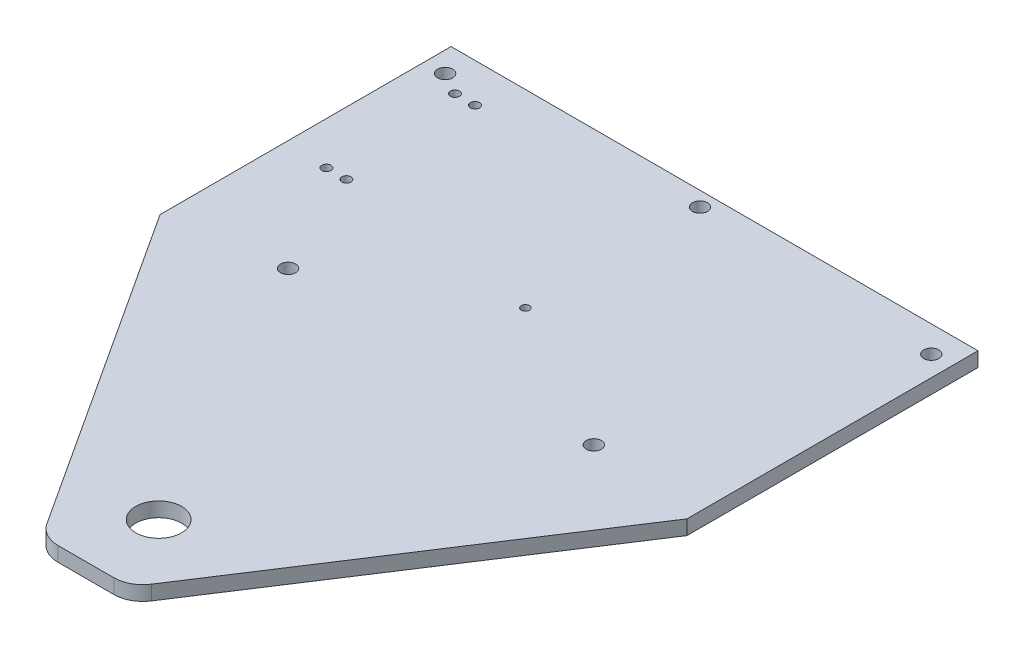
ISO-10303-21;
HEADER;
FILE_DESCRIPTION(('STEP AP214'),'2;1');
FILE_NAME('part.step','',(''),(''),'','','');
FILE_SCHEMA(('AUTOMOTIVE_DESIGN { 1 0 10303 214 1 1 1 1 }'));
ENDSEC;
DATA;
#1=APPLICATION_CONTEXT('core data for automotive mechanical design processes');
#2=APPLICATION_PROTOCOL_DEFINITION('international standard','automotive_design',2000,#1);
#3=PRODUCT_CONTEXT('',#1,'mechanical');
#4=PRODUCT('Part','Part','',(#3));
#5=PRODUCT_RELATED_PRODUCT_CATEGORY('part','',(#4));
#6=PRODUCT_DEFINITION_FORMATION('','',#4);
#7=PRODUCT_DEFINITION_CONTEXT('part definition',#1,'design');
#8=PRODUCT_DEFINITION('design','',#6,#7);
#9=PRODUCT_DEFINITION_SHAPE('','',#8);
#10=(LENGTH_UNIT() NAMED_UNIT(*) SI_UNIT(.MILLI.,.METRE.));
#11=(NAMED_UNIT(*) PLANE_ANGLE_UNIT() SI_UNIT($,.RADIAN.));
#12=(NAMED_UNIT(*) SI_UNIT($,.STERADIAN.) SOLID_ANGLE_UNIT());
#13=UNCERTAINTY_MEASURE_WITH_UNIT(LENGTH_MEASURE(1.E-05),#10,'distance_accuracy_value','');
#14=(GEOMETRIC_REPRESENTATION_CONTEXT(3) GLOBAL_UNCERTAINTY_ASSIGNED_CONTEXT((#13)) GLOBAL_UNIT_ASSIGNED_CONTEXT((#10,
#11,#12)) REPRESENTATION_CONTEXT('',''));
#15=CARTESIAN_POINT('',(0.,0.,0.));
#16=DIRECTION('',(0.,0.,1.));
#17=DIRECTION('',(1.,0.,0.));
#18=AXIS2_PLACEMENT_3D('',#15,#16,#17);
#19=CARTESIAN_POINT('',(-68.3666105948794,19.49,44.5148786296983));
#20=DIRECTION('',(-0.83801441935241,0.,0.545648085268742));
#21=DIRECTION('',(0.545648085268742,0.,0.83801441935241));
#22=AXIS2_PLACEMENT_3D('',#19,#20,#21);
#23=PLANE('',#22);
#24=DIRECTION('',(-0.545648085268742,0.,-0.83801441935241));
#25=VECTOR('',#24,1.);
#26=CARTESIAN_POINT('',(-68.3666105948794,16.315,44.5148786296983));
#27=LINE('',#26,#25);
#28=CARTESIAN_POINT('',(-36.8035693489561,16.315,92.9898653414566));
#29=VERTEX_POINT('',#28);
#30=CARTESIAN_POINT('',(-82.88,16.315,22.225));
#31=VERTEX_POINT('',#30);
#32=EDGE_CURVE('E158',#29,#31,#27,.T.);
#33=ORIENTED_EDGE('',*,*,#32,.F.);
#34=DIRECTION('',(0.,-1.,0.));
#35=VECTOR('',#34,1.);
#36=CARTESIAN_POINT('',(-36.8035693489561,19.49,92.9898653414565));
#37=LINE('',#36,#35);
#38=CARTESIAN_POINT('',(-36.8035693489561,19.49,92.9898653414566));
#39=VERTEX_POINT('',#38);
#40=EDGE_CURVE('E66',#29,#39,#37,.F.);
#41=ORIENTED_EDGE('',*,*,#40,.T.);
#42=DIRECTION('',(-0.545648085268742,0.,-0.83801441935241));
#43=VECTOR('',#42,1.);
#44=CARTESIAN_POINT('',(-68.3666105948794,19.49,44.5148786296983));
#45=LINE('',#44,#43);
#46=CARTESIAN_POINT('',(-82.88,19.49,22.225));
#47=VERTEX_POINT('',#46);
#48=EDGE_CURVE('E134',#39,#47,#45,.T.);
#49=ORIENTED_EDGE('',*,*,#48,.T.);
#50=DIRECTION('',(0.,-1.,0.));
#51=VECTOR('',#50,1.);
#52=CARTESIAN_POINT('',(-82.88,19.49,22.225));
#53=LINE('',#52,#51);
#54=EDGE_CURVE('E157',#47,#31,#53,.T.);
#55=ORIENTED_EDGE('',*,*,#54,.T.);
#56=EDGE_LOOP('',(#33,#41,#49,#55));
#57=FACE_BOUND('',#56,.T.);
#58=ADVANCED_FACE('F43',(#57),#23,.T.);
#59=CARTESIAN_POINT('',(0.,19.49,95.875));
#60=DIRECTION('',(0.,0.,1.));
#61=DIRECTION('',(1.,0.,0.));
#62=AXIS2_PLACEMENT_3D('',#59,#60,#61);
#63=PLANE('',#62);
#64=DIRECTION('',(-1.,0.,0.));
#65=VECTOR('',#64,1.);
#66=CARTESIAN_POINT('',(0.,19.49,95.875));
#67=LINE('',#66,#65);
#68=CARTESIAN_POINT('',(-19.3178222139362,19.49,95.875));
#69=VERTEX_POINT('',#68);
#70=CARTESIAN_POINT('',(-31.4821777860683,19.49,95.875));
#71=VERTEX_POINT('',#70);
#72=EDGE_CURVE('E131',#69,#71,#67,.T.);
#73=ORIENTED_EDGE('',*,*,#72,.T.);
#74=DIRECTION('',(0.,-1.,0.));
#75=VECTOR('',#74,1.);
#76=CARTESIAN_POINT('',(-31.4821777860683,19.49,95.875));
#77=LINE('',#76,#75);
#78=CARTESIAN_POINT('',(-31.4821777860683,16.315,95.875));
#79=VERTEX_POINT('',#78);
#80=EDGE_CURVE('E194',#71,#79,#77,.T.);
#81=ORIENTED_EDGE('',*,*,#80,.T.);
#82=DIRECTION('',(-1.,0.,0.));
#83=VECTOR('',#82,1.);
#84=CARTESIAN_POINT('',(0.,16.315,95.875));
#85=LINE('',#84,#83);
#86=CARTESIAN_POINT('',(-19.3178222139362,16.315,95.875));
#87=VERTEX_POINT('',#86);
#88=EDGE_CURVE('E160',#87,#79,#85,.T.);
#89=ORIENTED_EDGE('',*,*,#88,.F.);
#90=DIRECTION('',(0.,-1.,0.));
#91=VECTOR('',#90,1.);
#92=CARTESIAN_POINT('',(-19.3178222139362,19.49,95.875));
#93=LINE('',#92,#91);
#94=EDGE_CURVE('E119',#87,#69,#93,.F.);
#95=ORIENTED_EDGE('',*,*,#94,.T.);
#96=EDGE_LOOP('',(#73,#81,#89,#95));
#97=FACE_BOUND('',#96,.T.);
#98=ADVANCED_FACE('F206',(#97),#63,.T.);
#99=CARTESIAN_POINT('',(32.6913877091167,19.49,21.2860216916601));
#100=DIRECTION('',(0.838014419352385,0.,0.545648085268779));
#101=DIRECTION('',(0.545648085268779,0.,-0.838014419352385));
#102=AXIS2_PLACEMENT_3D('',#99,#100,#101);
#103=PLANE('',#102);
#104=DIRECTION('',(-0.545648085268779,0.,0.838014419352385));
#105=VECTOR('',#104,1.);
#106=CARTESIAN_POINT('',(32.6913877091167,19.49,21.2860216916601));
#107=LINE('',#106,#105);
#108=CARTESIAN_POINT('',(32.08,19.49,22.225));
#109=VERTEX_POINT('',#108);
#110=CARTESIAN_POINT('',(-13.9964306510485,19.49,92.9898653414568));
#111=VERTEX_POINT('',#110);
#112=EDGE_CURVE('E113',#109,#111,#107,.T.);
#113=ORIENTED_EDGE('',*,*,#112,.T.);
#114=DIRECTION('',(0.,-1.,0.));
#115=VECTOR('',#114,1.);
#116=CARTESIAN_POINT('',(-13.9964306510485,19.49,92.9898653414568));
#117=LINE('',#116,#115);
#118=CARTESIAN_POINT('',(-13.9964306510485,16.315,92.9898653414568));
#119=VERTEX_POINT('',#118);
#120=EDGE_CURVE('E11',#111,#119,#117,.T.);
#121=ORIENTED_EDGE('',*,*,#120,.T.);
#122=DIRECTION('',(-0.545648085268779,0.,0.838014419352385));
#123=VECTOR('',#122,1.);
#124=CARTESIAN_POINT('',(32.6913877091167,16.315,21.2860216916601));
#125=LINE('',#124,#123);
#126=CARTESIAN_POINT('',(32.08,16.315,22.225));
#127=VERTEX_POINT('',#126);
#128=EDGE_CURVE('E116',#127,#119,#125,.T.);
#129=ORIENTED_EDGE('',*,*,#128,.F.);
#130=DIRECTION('',(0.,-1.,0.));
#131=VECTOR('',#130,1.);
#132=CARTESIAN_POINT('',(32.08,19.49,22.225));
#133=LINE('',#132,#131);
#134=EDGE_CURVE('E110',#109,#127,#133,.T.);
#135=ORIENTED_EDGE('',*,*,#134,.F.);
#136=EDGE_LOOP('',(#113,#121,#129,#135));
#137=FACE_BOUND('',#136,.T.);
#138=ADVANCED_FACE('F112',(#137),#103,.T.);
#139=CARTESIAN_POINT('',(32.08,19.49,0.));
#140=DIRECTION('',(-1.,0.,0.));
#141=DIRECTION('',(0.,0.,1.));
#142=AXIS2_PLACEMENT_3D('',#139,#140,#141);
#143=PLANE('',#142);
#144=DIRECTION('',(0.,0.,-1.));
#145=VECTOR('',#144,1.);
#146=CARTESIAN_POINT('',(32.08,16.315,0.));
#147=LINE('',#146,#145);
#148=CARTESIAN_POINT('',(32.08,16.315,-41.275));
#149=VERTEX_POINT('',#148);
#150=EDGE_CURVE('E165',#127,#149,#147,.T.);
#151=ORIENTED_EDGE('',*,*,#150,.T.);
#152=DIRECTION('',(0.,-1.,0.));
#153=VECTOR('',#152,1.);
#154=CARTESIAN_POINT('',(32.08,19.49,-41.275));
#155=LINE('',#154,#153);
#156=CARTESIAN_POINT('',(32.08,19.49,-41.275));
#157=VERTEX_POINT('',#156);
#158=EDGE_CURVE('E120',#157,#149,#155,.T.);
#159=ORIENTED_EDGE('',*,*,#158,.F.);
#160=DIRECTION('',(0.,0.,-1.));
#161=VECTOR('',#160,1.);
#162=CARTESIAN_POINT('',(32.08,19.49,0.));
#163=LINE('',#162,#161);
#164=EDGE_CURVE('E123',#109,#157,#163,.T.);
#165=ORIENTED_EDGE('',*,*,#164,.F.);
#166=ORIENTED_EDGE('',*,*,#134,.T.);
#167=EDGE_LOOP('',(#151,#159,#165,#166));
#168=FACE_BOUND('',#167,.T.);
#169=ADVANCED_FACE('F124',(#168),#143,.F.);
#170=CARTESIAN_POINT('',(0.,19.49,-41.275));
#171=DIRECTION('',(0.,0.,1.));
#172=DIRECTION('',(1.,0.,0.));
#173=AXIS2_PLACEMENT_3D('',#170,#171,#172);
#174=PLANE('',#173);
#175=DIRECTION('',(-1.,0.,0.));
#176=VECTOR('',#175,1.);
#177=CARTESIAN_POINT('',(0.,16.315,-41.275));
#178=LINE('',#177,#176);
#179=CARTESIAN_POINT('',(-82.88,16.315,-41.275));
#180=VERTEX_POINT('',#179);
#181=EDGE_CURVE('E167',#149,#180,#178,.T.);
#182=ORIENTED_EDGE('',*,*,#181,.T.);
#183=DIRECTION('',(0.,-1.,0.));
#184=VECTOR('',#183,1.);
#185=CARTESIAN_POINT('',(-82.88,19.49,-41.275));
#186=LINE('',#185,#184);
#187=CARTESIAN_POINT('',(-82.88,19.49,-41.275));
#188=VERTEX_POINT('',#187);
#189=EDGE_CURVE('E189',#188,#180,#186,.T.);
#190=ORIENTED_EDGE('',*,*,#189,.F.);
#191=DIRECTION('',(-1.,0.,0.));
#192=VECTOR('',#191,1.);
#193=CARTESIAN_POINT('',(0.,19.49,-41.275));
#194=LINE('',#193,#192);
#195=EDGE_CURVE('E127',#157,#188,#194,.T.);
#196=ORIENTED_EDGE('',*,*,#195,.F.);
#197=ORIENTED_EDGE('',*,*,#158,.T.);
#198=EDGE_LOOP('',(#182,#190,#196,#197));
#199=FACE_BOUND('',#198,.T.);
#200=ADVANCED_FACE('F221',(#199),#174,.F.);
#201=CARTESIAN_POINT('',(7.95000000000004,19.49,18.415));
#202=DIRECTION('',(0.,-1.,0.));
#203=DIRECTION('',(0.,0.,-1.));
#204=AXIS2_PLACEMENT_3D('',#201,#202,#203);
#205=CYLINDRICAL_SURFACE('',#204,1.64999999999999);
#206=CARTESIAN_POINT('',(7.95000000000004,19.49,18.415));
#207=DIRECTION('',(0.,1.,0.));
#208=DIRECTION('',(0.,0.,1.));
#209=AXIS2_PLACEMENT_3D('',#206,#207,#208);
#210=CIRCLE('',#209,1.64999999999999);
#211=CARTESIAN_POINT('',(7.95000000000004,19.49,20.065));
#212=VERTEX_POINT('',#211);
#213=EDGE_CURVE('E151',#212,#212,#210,.F.);
#214=ORIENTED_EDGE('',*,*,#213,.F.);
#215=EDGE_LOOP('',(#214));
#216=FACE_BOUND('',#215,.T.);
#217=CARTESIAN_POINT('',(7.95000000000004,16.315,18.415));
#218=DIRECTION('',(0.,1.,0.));
#219=DIRECTION('',(0.,0.,1.));
#220=AXIS2_PLACEMENT_3D('',#217,#218,#219);
#221=CIRCLE('',#220,1.64999999999999);
#222=CARTESIAN_POINT('',(7.95000000000004,16.315,20.065));
#223=VERTEX_POINT('',#222);
#224=EDGE_CURVE('E181',#223,#223,#221,.F.);
#225=ORIENTED_EDGE('',*,*,#224,.T.);
#226=EDGE_LOOP('',(#225));
#227=FACE_BOUND('',#226,.T.);
#228=ADVANCED_FACE('F223',(#216,#227),#205,.F.);
#229=CARTESIAN_POINT('',(-25.4,19.49,-38.1));
#230=DIRECTION('',(0.,-1.,0.));
#231=DIRECTION('',(0.,0.,-1.));
#232=AXIS2_PLACEMENT_3D('',#229,#230,#231);
#233=CYLINDRICAL_SURFACE('',#232,1.64999999999999);
#234=CARTESIAN_POINT('',(-25.4,19.49,-38.1));
#235=DIRECTION('',(0.,1.,0.));
#236=DIRECTION('',(0.,0.,1.));
#237=AXIS2_PLACEMENT_3D('',#234,#235,#236);
#238=CIRCLE('',#237,1.64999999999999);
#239=CARTESIAN_POINT('',(-25.4,19.49,-36.45));
#240=VERTEX_POINT('',#239);
#241=EDGE_CURVE('E148',#240,#240,#238,.F.);
#242=ORIENTED_EDGE('',*,*,#241,.F.);
#243=EDGE_LOOP('',(#242));
#244=FACE_BOUND('',#243,.T.);
#245=CARTESIAN_POINT('',(-25.4,16.315,-38.1));
#246=DIRECTION('',(0.,1.,0.));
#247=DIRECTION('',(0.,0.,1.));
#248=AXIS2_PLACEMENT_3D('',#245,#246,#247);
#249=CIRCLE('',#248,1.64999999999999);
#250=CARTESIAN_POINT('',(-25.4,16.315,-36.45));
#251=VERTEX_POINT('',#250);
#252=EDGE_CURVE('E178',#251,#251,#249,.F.);
#253=ORIENTED_EDGE('',*,*,#252,.T.);
#254=EDGE_LOOP('',(#253));
#255=FACE_BOUND('',#254,.T.);
#256=ADVANCED_FACE('F229',(#244,#255),#233,.F.);
#257=CARTESIAN_POINT('',(27.635,19.49,-35.5324467561579));
#258=DIRECTION('',(0.,-1.,0.));
#259=DIRECTION('',(0.,0.,-1.));
#260=AXIS2_PLACEMENT_3D('',#257,#258,#259);
#261=CYLINDRICAL_SURFACE('',#260,1.64999999999999);
#262=CARTESIAN_POINT('',(27.635,19.49,-35.5324467561579));
#263=DIRECTION('',(0.,1.,0.));
#264=DIRECTION('',(0.,0.,1.));
#265=AXIS2_PLACEMENT_3D('',#262,#263,#264);
#266=CIRCLE('',#265,1.64999999999999);
#267=CARTESIAN_POINT('',(27.635,19.49,-33.8824467561579));
#268=VERTEX_POINT('',#267);
#269=EDGE_CURVE('E145',#268,#268,#266,.F.);
#270=ORIENTED_EDGE('',*,*,#269,.F.);
#271=EDGE_LOOP('',(#270));
#272=FACE_BOUND('',#271,.T.);
#273=CARTESIAN_POINT('',(27.635,16.315,-35.5324467561579));
#274=DIRECTION('',(0.,1.,0.));
#275=DIRECTION('',(0.,0.,1.));
#276=AXIS2_PLACEMENT_3D('',#273,#274,#275);
#277=CIRCLE('',#276,1.64999999999999);
#278=CARTESIAN_POINT('',(27.635,16.315,-33.8824467561579));
#279=VERTEX_POINT('',#278);
#280=EDGE_CURVE('E175',#279,#279,#277,.F.);
#281=ORIENTED_EDGE('',*,*,#280,.T.);
#282=EDGE_LOOP('',(#281));
#283=FACE_BOUND('',#282,.T.);
#284=ADVANCED_FACE('F287',(#272,#283),#261,.F.);
#285=CARTESIAN_POINT('',(-58.75,19.49,18.415));
#286=DIRECTION('',(0.,-1.,0.));
#287=DIRECTION('',(0.,0.,-1.));
#288=AXIS2_PLACEMENT_3D('',#285,#286,#287);
#289=CYLINDRICAL_SURFACE('',#288,1.64999999999999);
#290=CARTESIAN_POINT('',(-58.75,19.49,18.415));
#291=DIRECTION('',(0.,1.,0.));
#292=DIRECTION('',(0.,0.,1.));
#293=AXIS2_PLACEMENT_3D('',#290,#291,#292);
#294=CIRCLE('',#293,1.64999999999999);
#295=CARTESIAN_POINT('',(-58.75,19.49,20.065));
#296=VERTEX_POINT('',#295);
#297=EDGE_CURVE('E142',#296,#296,#294,.F.);
#298=ORIENTED_EDGE('',*,*,#297,.F.);
#299=EDGE_LOOP('',(#298));
#300=FACE_BOUND('',#299,.T.);
#301=CARTESIAN_POINT('',(-58.75,16.315,18.415));
#302=DIRECTION('',(0.,1.,0.));
#303=DIRECTION('',(0.,0.,1.));
#304=AXIS2_PLACEMENT_3D('',#301,#302,#303);
#305=CIRCLE('',#304,1.64999999999999);
#306=CARTESIAN_POINT('',(-58.75,16.315,20.065));
#307=VERTEX_POINT('',#306);
#308=EDGE_CURVE('E172',#307,#307,#305,.F.);
#309=ORIENTED_EDGE('',*,*,#308,.T.);
#310=EDGE_LOOP('',(#309));
#311=FACE_BOUND('',#310,.T.);
#312=ADVANCED_FACE('F291',(#300,#311),#289,.F.);
#313=CARTESIAN_POINT('',(-82.88,19.49,0.));
#314=DIRECTION('',(1.,0.,0.));
#315=DIRECTION('',(0.,0.,-1.));
#316=AXIS2_PLACEMENT_3D('',#313,#314,#315);
#317=PLANE('',#316);
#318=DIRECTION('',(0.,0.,1.));
#319=VECTOR('',#318,1.);
#320=CARTESIAN_POINT('',(-82.88,16.315,0.));
#321=LINE('',#320,#319);
#322=EDGE_CURVE('E169',#180,#31,#321,.T.);
#323=ORIENTED_EDGE('',*,*,#322,.T.);
#324=ORIENTED_EDGE('',*,*,#54,.F.);
#325=DIRECTION('',(0.,0.,1.));
#326=VECTOR('',#325,1.);
#327=CARTESIAN_POINT('',(-82.88,19.49,0.));
#328=LINE('',#327,#326);
#329=EDGE_CURVE('E139',#188,#47,#328,.T.);
#330=ORIENTED_EDGE('',*,*,#329,.F.);
#331=ORIENTED_EDGE('',*,*,#189,.T.);
#332=EDGE_LOOP('',(#323,#324,#330,#331));
#333=FACE_BOUND('',#332,.T.);
#334=ADVANCED_FACE('F217',(#333),#317,.F.);
#335=CARTESIAN_POINT('',(-78.435,19.49,-35.5324467561579));
#336=DIRECTION('',(0.,-1.,0.));
#337=DIRECTION('',(0.,0.,-1.));
#338=AXIS2_PLACEMENT_3D('',#335,#336,#337);
#339=CYLINDRICAL_SURFACE('',#338,1.64999999999998);
#340=CARTESIAN_POINT('',(-78.435,19.49,-35.5324467561579));
#341=DIRECTION('',(0.,1.,0.));
#342=DIRECTION('',(0.,0.,1.));
#343=AXIS2_PLACEMENT_3D('',#340,#341,#342);
#344=CIRCLE('',#343,1.64999999999998);
#345=CARTESIAN_POINT('',(-78.435,19.49,-33.8824467561579));
#346=VERTEX_POINT('',#345);
#347=EDGE_CURVE('E154',#346,#346,#344,.F.);
#348=ORIENTED_EDGE('',*,*,#347,.F.);
#349=EDGE_LOOP('',(#348));
#350=FACE_BOUND('',#349,.T.);
#351=CARTESIAN_POINT('',(-78.435,16.315,-35.5324467561579));
#352=DIRECTION('',(0.,1.,0.));
#353=DIRECTION('',(0.,0.,1.));
#354=AXIS2_PLACEMENT_3D('',#351,#352,#353);
#355=CIRCLE('',#354,1.64999999999998);
#356=CARTESIAN_POINT('',(-78.435,16.315,-33.8824467561579));
#357=VERTEX_POINT('',#356);
#358=EDGE_CURVE('E184',#357,#357,#355,.F.);
#359=ORIENTED_EDGE('',*,*,#358,.T.);
#360=EDGE_LOOP('',(#359));
#361=FACE_BOUND('',#360,.T.);
#362=ADVANCED_FACE('F278',(#350,#361),#339,.F.);
#363=CARTESIAN_POINT('',(0.,19.49,0.));
#364=DIRECTION('',(0.,1.,0.));
#365=DIRECTION('',(0.,0.,1.));
#366=AXIS2_PLACEMENT_3D('',#363,#364,#365);
#367=PLANE('',#366);
#368=CARTESIAN_POINT('',(-73.5581080719325,19.49,-4.75000000000001));
#369=DIRECTION('',(0.,1.,0.));
#370=DIRECTION('',(0.,0.,1.));
#371=AXIS2_PLACEMENT_3D('',#368,#369,#370);
#372=CIRCLE('',#371,0.999999999999998);
#373=CARTESIAN_POINT('',(-73.5581080719325,19.49,-3.75000000000002));
#374=VERTEX_POINT('',#373);
#375=EDGE_CURVE('E483',#374,#374,#372,.T.);
#376=ORIENTED_EDGE('',*,*,#375,.F.);
#377=EDGE_LOOP('',(#376));
#378=FACE_BOUND('',#377,.T.);
#379=CARTESIAN_POINT('',(-69.1870821501849,19.49,-4.75000000000001));
#380=DIRECTION('',(0.,1.,0.));
#381=DIRECTION('',(0.,0.,1.));
#382=AXIS2_PLACEMENT_3D('',#379,#380,#381);
#383=CIRCLE('',#382,0.999999999999998);
#384=CARTESIAN_POINT('',(-69.1870821501849,19.49,-3.75000000000002));
#385=VERTEX_POINT('',#384);
#386=EDGE_CURVE('E486',#385,#385,#383,.T.);
#387=ORIENTED_EDGE('',*,*,#386,.F.);
#388=EDGE_LOOP('',(#387));
#389=FACE_BOUND('',#388,.T.);
#390=CARTESIAN_POINT('',(-69.1870821501849,19.49,-32.8));
#391=DIRECTION('',(0.,1.,0.));
#392=DIRECTION('',(0.,0.,1.));
#393=AXIS2_PLACEMENT_3D('',#390,#391,#392);
#394=CIRCLE('',#393,0.999999999999998);
#395=CARTESIAN_POINT('',(-69.1870821501849,19.49,-31.8));
#396=VERTEX_POINT('',#395);
#397=EDGE_CURVE('E489',#396,#396,#394,.T.);
#398=ORIENTED_EDGE('',*,*,#397,.F.);
#399=EDGE_LOOP('',(#398));
#400=FACE_BOUND('',#399,.T.);
#401=CARTESIAN_POINT('',(-73.5581080719325,19.49,-32.8));
#402=DIRECTION('',(0.,1.,0.));
#403=DIRECTION('',(0.,0.,1.));
#404=AXIS2_PLACEMENT_3D('',#401,#402,#403);
#405=CIRCLE('',#404,0.999999999999998);
#406=CARTESIAN_POINT('',(-73.5581080719325,19.49,-31.8));
#407=VERTEX_POINT('',#406);
#408=EDGE_CURVE('E492',#407,#407,#405,.T.);
#409=ORIENTED_EDGE('',*,*,#408,.F.);
#410=EDGE_LOOP('',(#409));
#411=FACE_BOUND('',#410,.T.);
#412=CARTESIAN_POINT('',(-25.4,19.49,80.));
#413=DIRECTION('',(0.,1.,0.));
#414=DIRECTION('',(0.,0.,1.));
#415=AXIS2_PLACEMENT_3D('',#412,#413,#414);
#416=CIRCLE('',#415,4.99999999999999);
#417=CARTESIAN_POINT('',(-25.4,19.49,85.));
#418=VERTEX_POINT('',#417);
#419=EDGE_CURVE('E480',#418,#418,#416,.T.);
#420=ORIENTED_EDGE('',*,*,#419,.F.);
#421=EDGE_LOOP('',(#420));
#422=FACE_BOUND('',#421,.T.);
#423=CARTESIAN_POINT('',(-25.4,19.49,0.));
#424=DIRECTION('',(0.,1.,0.));
#425=DIRECTION('',(0.,0.,1.));
#426=AXIS2_PLACEMENT_3D('',#423,#424,#425);
#427=CIRCLE('',#426,0.889);
#428=CARTESIAN_POINT('',(-25.4,19.49,0.889000000000021));
#429=VERTEX_POINT('',#428);
#430=EDGE_CURVE('E475',#429,#429,#427,.T.);
#431=ORIENTED_EDGE('',*,*,#430,.F.);
#432=EDGE_LOOP('',(#431));
#433=FACE_BOUND('',#432,.T.);
#434=ORIENTED_EDGE('',*,*,#48,.F.);
#435=CARTESIAN_POINT('',(-31.4821777860683,19.49,89.525));
#436=DIRECTION('',(0.,1.,0.));
#437=DIRECTION('',(0.,0.,1.));
#438=AXIS2_PLACEMENT_3D('',#435,#436,#437);
#439=CIRCLE('',#438,6.35);
#440=EDGE_CURVE('E51',#39,#71,#439,.T.);
#441=ORIENTED_EDGE('',*,*,#440,.T.);
#442=ORIENTED_EDGE('',*,*,#72,.F.);
#443=CARTESIAN_POINT('',(-19.3178222139362,19.49,89.525));
#444=DIRECTION('',(0.,1.,0.));
#445=DIRECTION('',(0.,0.,1.));
#446=AXIS2_PLACEMENT_3D('',#443,#444,#445);
#447=CIRCLE('',#446,6.35);
#448=EDGE_CURVE('E58',#69,#111,#447,.T.);
#449=ORIENTED_EDGE('',*,*,#448,.T.);
#450=ORIENTED_EDGE('',*,*,#112,.F.);
#451=ORIENTED_EDGE('',*,*,#164,.T.);
#452=ORIENTED_EDGE('',*,*,#195,.T.);
#453=ORIENTED_EDGE('',*,*,#329,.T.);
#454=EDGE_LOOP('',(#434,#441,#442,#449,#450,#451,#452,#453));
#455=FACE_BOUND('',#454,.T.);
#456=ORIENTED_EDGE('',*,*,#297,.T.);
#457=EDGE_LOOP('',(#456));
#458=FACE_BOUND('',#457,.T.);
#459=ORIENTED_EDGE('',*,*,#269,.T.);
#460=EDGE_LOOP('',(#459));
#461=FACE_BOUND('',#460,.T.);
#462=ORIENTED_EDGE('',*,*,#241,.T.);
#463=EDGE_LOOP('',(#462));
#464=FACE_BOUND('',#463,.T.);
#465=ORIENTED_EDGE('',*,*,#213,.T.);
#466=EDGE_LOOP('',(#465));
#467=FACE_BOUND('',#466,.T.);
#468=ORIENTED_EDGE('',*,*,#347,.T.);
#469=EDGE_LOOP('',(#468));
#470=FACE_BOUND('',#469,.T.);
#471=ADVANCED_FACE('F129',(#378,#389,#400,#411,#422,#433,#455,#458,#461,#464,#467,#470),#367,.T.);
#472=CARTESIAN_POINT('',(0.,16.315,0.));
#473=DIRECTION('',(0.,1.,0.));
#474=DIRECTION('',(0.,0.,1.));
#475=AXIS2_PLACEMENT_3D('',#472,#473,#474);
#476=PLANE('',#475);
#477=CARTESIAN_POINT('',(-73.5581080719325,16.315,-4.75000000000001));
#478=DIRECTION('',(0.,1.,0.));
#479=DIRECTION('',(0.,0.,1.));
#480=AXIS2_PLACEMENT_3D('',#477,#478,#479);
#481=CIRCLE('',#480,0.999999999999998);
#482=CARTESIAN_POINT('',(-73.5581080719325,16.315,-3.75000000000002));
#483=VERTEX_POINT('',#482);
#484=EDGE_CURVE('E456',#483,#483,#481,.T.);
#485=ORIENTED_EDGE('',*,*,#484,.T.);
#486=EDGE_LOOP('',(#485));
#487=FACE_BOUND('',#486,.T.);
#488=CARTESIAN_POINT('',(-69.1870821501849,16.315,-4.75000000000001));
#489=DIRECTION('',(0.,1.,0.));
#490=DIRECTION('',(0.,0.,1.));
#491=AXIS2_PLACEMENT_3D('',#488,#489,#490);
#492=CIRCLE('',#491,0.999999999999998);
#493=CARTESIAN_POINT('',(-69.1870821501849,16.315,-3.75000000000002));
#494=VERTEX_POINT('',#493);
#495=EDGE_CURVE('E460',#494,#494,#492,.T.);
#496=ORIENTED_EDGE('',*,*,#495,.T.);
#497=EDGE_LOOP('',(#496));
#498=FACE_BOUND('',#497,.T.);
#499=CARTESIAN_POINT('',(-69.1870821501849,16.315,-32.8));
#500=DIRECTION('',(0.,1.,0.));
#501=DIRECTION('',(0.,0.,1.));
#502=AXIS2_PLACEMENT_3D('',#499,#500,#501);
#503=CIRCLE('',#502,0.999999999999998);
#504=CARTESIAN_POINT('',(-69.1870821501849,16.315,-31.8));
#505=VERTEX_POINT('',#504);
#506=EDGE_CURVE('E464',#505,#505,#503,.T.);
#507=ORIENTED_EDGE('',*,*,#506,.T.);
#508=EDGE_LOOP('',(#507));
#509=FACE_BOUND('',#508,.T.);
#510=CARTESIAN_POINT('',(-73.5581080719325,16.315,-32.8));
#511=DIRECTION('',(0.,1.,0.));
#512=DIRECTION('',(0.,0.,1.));
#513=AXIS2_PLACEMENT_3D('',#510,#511,#512);
#514=CIRCLE('',#513,0.999999999999998);
#515=CARTESIAN_POINT('',(-73.5581080719325,16.315,-31.8));
#516=VERTEX_POINT('',#515);
#517=EDGE_CURVE('E468',#516,#516,#514,.T.);
#518=ORIENTED_EDGE('',*,*,#517,.T.);
#519=EDGE_LOOP('',(#518));
#520=FACE_BOUND('',#519,.T.);
#521=CARTESIAN_POINT('',(-25.4,16.315,80.));
#522=DIRECTION('',(0.,1.,0.));
#523=DIRECTION('',(0.,0.,1.));
#524=AXIS2_PLACEMENT_3D('',#521,#522,#523);
#525=CIRCLE('',#524,4.99999999999999);
#526=CARTESIAN_POINT('',(-25.4,16.315,85.));
#527=VERTEX_POINT('',#526);
#528=EDGE_CURVE('E472',#527,#527,#525,.T.);
#529=ORIENTED_EDGE('',*,*,#528,.T.);
#530=EDGE_LOOP('',(#529));
#531=FACE_BOUND('',#530,.T.);
#532=CARTESIAN_POINT('',(-25.4,16.315,0.));
#533=DIRECTION('',(0.,1.,0.));
#534=DIRECTION('',(0.,0.,1.));
#535=AXIS2_PLACEMENT_3D('',#532,#533,#534);
#536=CIRCLE('',#535,0.889);
#537=CARTESIAN_POINT('',(-25.4,16.315,0.889000000000021));
#538=VERTEX_POINT('',#537);
#539=EDGE_CURVE('E161',#538,#538,#536,.T.);
#540=ORIENTED_EDGE('',*,*,#539,.T.);
#541=EDGE_LOOP('',(#540));
#542=FACE_BOUND('',#541,.T.);
#543=ORIENTED_EDGE('',*,*,#88,.T.);
#544=CARTESIAN_POINT('',(-31.4821777860683,16.315,89.525));
#545=DIRECTION('',(0.,1.,0.));
#546=DIRECTION('',(0.,0.,1.));
#547=AXIS2_PLACEMENT_3D('',#544,#545,#546);
#548=CIRCLE('',#547,6.35);
#549=EDGE_CURVE('E199',#79,#29,#548,.F.);
#550=ORIENTED_EDGE('',*,*,#549,.T.);
#551=ORIENTED_EDGE('',*,*,#32,.T.);
#552=ORIENTED_EDGE('',*,*,#322,.F.);
#553=ORIENTED_EDGE('',*,*,#181,.F.);
#554=ORIENTED_EDGE('',*,*,#150,.F.);
#555=ORIENTED_EDGE('',*,*,#128,.T.);
#556=CARTESIAN_POINT('',(-19.3178222139362,16.315,89.525));
#557=DIRECTION('',(0.,1.,0.));
#558=DIRECTION('',(0.,0.,1.));
#559=AXIS2_PLACEMENT_3D('',#556,#557,#558);
#560=CIRCLE('',#559,6.35);
#561=EDGE_CURVE('E197',#119,#87,#560,.F.);
#562=ORIENTED_EDGE('',*,*,#561,.T.);
#563=EDGE_LOOP('',(#543,#550,#551,#552,#553,#554,#555,#562));
#564=FACE_BOUND('',#563,.T.);
#565=ORIENTED_EDGE('',*,*,#308,.F.);
#566=EDGE_LOOP('',(#565));
#567=FACE_BOUND('',#566,.T.);
#568=ORIENTED_EDGE('',*,*,#280,.F.);
#569=EDGE_LOOP('',(#568));
#570=FACE_BOUND('',#569,.T.);
#571=ORIENTED_EDGE('',*,*,#252,.F.);
#572=EDGE_LOOP('',(#571));
#573=FACE_BOUND('',#572,.T.);
#574=ORIENTED_EDGE('',*,*,#224,.F.);
#575=EDGE_LOOP('',(#574));
#576=FACE_BOUND('',#575,.T.);
#577=ORIENTED_EDGE('',*,*,#358,.F.);
#578=EDGE_LOOP('',(#577));
#579=FACE_BOUND('',#578,.T.);
#580=ADVANCED_FACE('F211',(#487,#498,#509,#520,#531,#542,#564,#567,#570,#573,#576,#579),#476,.F.);
#581=CARTESIAN_POINT('',(-25.4,16.315,0.));
#582=DIRECTION('',(0.,1.,0.));
#583=DIRECTION('',(0.,0.,1.));
#584=AXIS2_PLACEMENT_3D('',#581,#582,#583);
#585=CYLINDRICAL_SURFACE('',#584,0.889);
#586=ORIENTED_EDGE('',*,*,#539,.F.);
#587=EDGE_LOOP('',(#586));
#588=FACE_BOUND('',#587,.T.);
#589=ORIENTED_EDGE('',*,*,#430,.T.);
#590=EDGE_LOOP('',(#589));
#591=FACE_BOUND('',#590,.T.);
#592=ADVANCED_FACE('F271',(#588,#591),#585,.F.);
#593=CARTESIAN_POINT('',(-25.4,16.315,80.));
#594=DIRECTION('',(0.,1.,0.));
#595=DIRECTION('',(0.,0.,1.));
#596=AXIS2_PLACEMENT_3D('',#593,#594,#595);
#597=CYLINDRICAL_SURFACE('',#596,4.99999999999999);
#598=ORIENTED_EDGE('',*,*,#528,.F.);
#599=EDGE_LOOP('',(#598));
#600=FACE_BOUND('',#599,.T.);
#601=ORIENTED_EDGE('',*,*,#419,.T.);
#602=EDGE_LOOP('',(#601));
#603=FACE_BOUND('',#602,.T.);
#604=ADVANCED_FACE('F267',(#600,#603),#597,.F.);
#605=CARTESIAN_POINT('',(-73.5581080719325,16.315,-32.8));
#606=DIRECTION('',(0.,1.,0.));
#607=DIRECTION('',(0.,0.,1.));
#608=AXIS2_PLACEMENT_3D('',#605,#606,#607);
#609=CYLINDRICAL_SURFACE('',#608,0.999999999999998);
#610=ORIENTED_EDGE('',*,*,#408,.T.);
#611=EDGE_LOOP('',(#610));
#612=FACE_BOUND('',#611,.T.);
#613=ORIENTED_EDGE('',*,*,#517,.F.);
#614=EDGE_LOOP('',(#613));
#615=FACE_BOUND('',#614,.T.);
#616=ADVANCED_FACE('F263',(#612,#615),#609,.F.);
#617=CARTESIAN_POINT('',(-69.1870821501849,16.315,-32.8));
#618=DIRECTION('',(0.,1.,0.));
#619=DIRECTION('',(0.,0.,1.));
#620=AXIS2_PLACEMENT_3D('',#617,#618,#619);
#621=CYLINDRICAL_SURFACE('',#620,0.999999999999998);
#622=ORIENTED_EDGE('',*,*,#397,.T.);
#623=EDGE_LOOP('',(#622));
#624=FACE_BOUND('',#623,.T.);
#625=ORIENTED_EDGE('',*,*,#506,.F.);
#626=EDGE_LOOP('',(#625));
#627=FACE_BOUND('',#626,.T.);
#628=ADVANCED_FACE('F255',(#624,#627),#621,.F.);
#629=CARTESIAN_POINT('',(-69.1870821501849,16.315,-4.75000000000001));
#630=DIRECTION('',(0.,1.,0.));
#631=DIRECTION('',(0.,0.,1.));
#632=AXIS2_PLACEMENT_3D('',#629,#630,#631);
#633=CYLINDRICAL_SURFACE('',#632,0.999999999999998);
#634=ORIENTED_EDGE('',*,*,#386,.T.);
#635=EDGE_LOOP('',(#634));
#636=FACE_BOUND('',#635,.T.);
#637=ORIENTED_EDGE('',*,*,#495,.F.);
#638=EDGE_LOOP('',(#637));
#639=FACE_BOUND('',#638,.T.);
#640=ADVANCED_FACE('F249',(#636,#639),#633,.F.);
#641=CARTESIAN_POINT('',(-73.5581080719325,16.315,-4.75000000000001));
#642=DIRECTION('',(0.,1.,0.));
#643=DIRECTION('',(0.,0.,1.));
#644=AXIS2_PLACEMENT_3D('',#641,#642,#643);
#645=CYLINDRICAL_SURFACE('',#644,0.999999999999998);
#646=ORIENTED_EDGE('',*,*,#375,.T.);
#647=EDGE_LOOP('',(#646));
#648=FACE_BOUND('',#647,.T.);
#649=ORIENTED_EDGE('',*,*,#484,.F.);
#650=EDGE_LOOP('',(#649));
#651=FACE_BOUND('',#650,.T.);
#652=ADVANCED_FACE('F243',(#648,#651),#645,.F.);
#653=CARTESIAN_POINT('',(-31.4821777860683,19.49,89.525));
#654=DIRECTION('',(0.,-1.,0.));
#655=DIRECTION('',(0.,0.,-1.));
#656=AXIS2_PLACEMENT_3D('',#653,#654,#655);
#657=CYLINDRICAL_SURFACE('',#656,6.35);
#658=ORIENTED_EDGE('',*,*,#440,.F.);
#659=ORIENTED_EDGE('',*,*,#40,.F.);
#660=ORIENTED_EDGE('',*,*,#549,.F.);
#661=ORIENTED_EDGE('',*,*,#80,.F.);
#662=EDGE_LOOP('',(#658,#659,#660,#661));
#663=FACE_BOUND('',#662,.T.);
#664=ADVANCED_FACE('F209',(#663),#657,.T.);
#665=CARTESIAN_POINT('',(-19.3178222139362,19.49,89.525));
#666=DIRECTION('',(0.,-1.,0.));
#667=DIRECTION('',(0.,0.,-1.));
#668=AXIS2_PLACEMENT_3D('',#665,#666,#667);
#669=CYLINDRICAL_SURFACE('',#668,6.35);
#670=ORIENTED_EDGE('',*,*,#448,.F.);
#671=ORIENTED_EDGE('',*,*,#94,.F.);
#672=ORIENTED_EDGE('',*,*,#561,.F.);
#673=ORIENTED_EDGE('',*,*,#120,.F.);
#674=EDGE_LOOP('',(#670,#671,#672,#673));
#675=FACE_BOUND('',#674,.T.);
#676=ADVANCED_FACE('F45',(#675),#669,.T.);
#677=CLOSED_SHELL('',(#58,#98,#138,#169,#200,#228,#256,#284,#312,#334,#362,#471,#580,#592,#604,
#616,#628,#640,#652,#664,#676));
#678=MANIFOLD_SOLID_BREP('B2',#677);
#679=ADVANCED_BREP_SHAPE_REPRESENTATION('',(#18,#678),#14);
#680=SHAPE_DEFINITION_REPRESENTATION(#9,#679);
ENDSEC;
END-ISO-10303-21;
